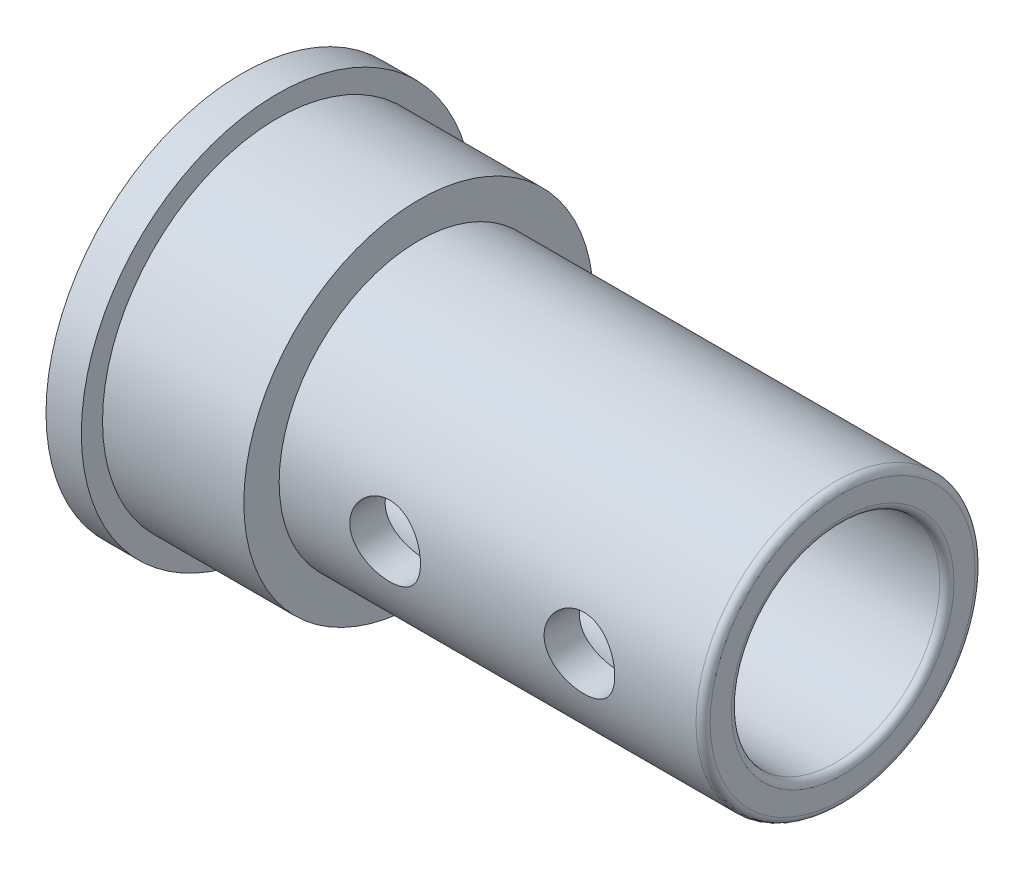
ISO-10303-21;
HEADER;
FILE_DESCRIPTION(('STEP AP214'),'2;1');
FILE_NAME('part.step','',(''),(''),'','','');
FILE_SCHEMA(('AUTOMOTIVE_DESIGN { 1 0 10303 214 1 1 1 1 }'));
ENDSEC;
DATA;
#1=APPLICATION_CONTEXT('core data for automotive mechanical design processes');
#2=APPLICATION_PROTOCOL_DEFINITION('international standard','automotive_design',2000,#1);
#3=PRODUCT_CONTEXT('',#1,'mechanical');
#4=PRODUCT('Part','Part','',(#3));
#5=PRODUCT_RELATED_PRODUCT_CATEGORY('part','',(#4));
#6=PRODUCT_DEFINITION_FORMATION('','',#4);
#7=PRODUCT_DEFINITION_CONTEXT('part definition',#1,'design');
#8=PRODUCT_DEFINITION('design','',#6,#7);
#9=PRODUCT_DEFINITION_SHAPE('','',#8);
#10=(LENGTH_UNIT() NAMED_UNIT(*) SI_UNIT(.MILLI.,.METRE.));
#11=(NAMED_UNIT(*) PLANE_ANGLE_UNIT() SI_UNIT($,.RADIAN.));
#12=(NAMED_UNIT(*) SI_UNIT($,.STERADIAN.) SOLID_ANGLE_UNIT());
#13=UNCERTAINTY_MEASURE_WITH_UNIT(LENGTH_MEASURE(1.E-05),#10,'distance_accuracy_value','');
#14=(GEOMETRIC_REPRESENTATION_CONTEXT(3) GLOBAL_UNCERTAINTY_ASSIGNED_CONTEXT((#13)) GLOBAL_UNIT_ASSIGNED_CONTEXT((#10,
#11,#12)) REPRESENTATION_CONTEXT('',''));
#15=CARTESIAN_POINT('',(0.,0.,0.));
#16=DIRECTION('',(0.,0.,1.));
#17=DIRECTION('',(1.,0.,0.));
#18=AXIS2_PLACEMENT_3D('',#15,#16,#17);
#19=CARTESIAN_POINT('',(-11.3005884112895,0.,0.));
#20=DIRECTION('',(-1.,0.,0.));
#21=DIRECTION('',(0.,0.,1.));
#22=AXIS2_PLACEMENT_3D('',#19,#20,#21);
#23=CYLINDRICAL_SURFACE('',#22,4.05);
#24=CARTESIAN_POINT('',(1.,0.,0.));
#25=DIRECTION('',(-1.,0.,0.));
#26=DIRECTION('',(0.,0.,1.));
#27=AXIS2_PLACEMENT_3D('',#24,#25,#26);
#28=CIRCLE('',#27,4.05);
#29=CARTESIAN_POINT('',(1.,0.,4.05));
#30=VERTEX_POINT('',#29);
#31=EDGE_CURVE('E79',#30,#30,#28,.T.);
#32=ORIENTED_EDGE('',*,*,#31,.F.);
#33=EDGE_LOOP('',(#32));
#34=FACE_BOUND('',#33,.T.);
#35=CARTESIAN_POINT('',(0.,0.,0.));
#36=DIRECTION('',(-1.,0.,0.));
#37=DIRECTION('',(0.,0.,1.));
#38=AXIS2_PLACEMENT_3D('',#35,#36,#37);
#39=CIRCLE('',#38,4.05);
#40=CARTESIAN_POINT('',(0.,0.,4.05));
#41=VERTEX_POINT('',#40);
#42=EDGE_CURVE('E10',#41,#41,#39,.T.);
#43=ORIENTED_EDGE('',*,*,#42,.T.);
#44=EDGE_LOOP('',(#43));
#45=FACE_BOUND('',#44,.T.);
#46=ADVANCED_FACE('F31',(#34,#45),#23,.F.);
#47=CARTESIAN_POINT('',(0.,4.05,0.));
#48=DIRECTION('',(1.,0.,0.));
#49=DIRECTION('',(0.,0.,-1.));
#50=AXIS2_PLACEMENT_3D('',#47,#48,#49);
#51=PLANE('',#50);
#52=ORIENTED_EDGE('',*,*,#42,.F.);
#53=EDGE_LOOP('',(#52));
#54=FACE_BOUND('',#53,.T.);
#55=CARTESIAN_POINT('',(0.,0.,0.));
#56=DIRECTION('',(-1.,0.,0.));
#57=DIRECTION('',(0.,0.,1.));
#58=AXIS2_PLACEMENT_3D('',#55,#56,#57);
#59=CIRCLE('',#58,5.55);
#60=CARTESIAN_POINT('',(0.,0.,5.55));
#61=VERTEX_POINT('',#60);
#62=EDGE_CURVE('E43',#61,#61,#59,.T.);
#63=ORIENTED_EDGE('',*,*,#62,.T.);
#64=EDGE_LOOP('',(#63));
#65=FACE_BOUND('',#64,.T.);
#66=ADVANCED_FACE('F107',(#54,#65),#51,.F.);
#67=CARTESIAN_POINT('',(-11.3005884112895,0.,0.));
#68=DIRECTION('',(-1.,0.,0.));
#69=DIRECTION('',(0.,0.,1.));
#70=AXIS2_PLACEMENT_3D('',#67,#68,#69);
#71=CYLINDRICAL_SURFACE('',#70,5.55);
#72=ORIENTED_EDGE('',*,*,#62,.F.);
#73=EDGE_LOOP('',(#72));
#74=FACE_BOUND('',#73,.T.);
#75=CARTESIAN_POINT('',(1.,0.,0.));
#76=DIRECTION('',(-1.,0.,0.));
#77=DIRECTION('',(0.,0.,1.));
#78=AXIS2_PLACEMENT_3D('',#75,#76,#77);
#79=CIRCLE('',#78,5.55);
#80=CARTESIAN_POINT('',(1.,0.,5.55));
#81=VERTEX_POINT('',#80);
#82=EDGE_CURVE('E48',#81,#81,#79,.T.);
#83=ORIENTED_EDGE('',*,*,#82,.T.);
#84=EDGE_LOOP('',(#83));
#85=FACE_BOUND('',#84,.T.);
#86=ADVANCED_FACE('F104',(#74,#85),#71,.T.);
#87=CARTESIAN_POINT('',(1.,5.55,0.));
#88=DIRECTION('',(-1.,0.,0.));
#89=DIRECTION('',(0.,0.,1.));
#90=AXIS2_PLACEMENT_3D('',#87,#88,#89);
#91=PLANE('',#90);
#92=ORIENTED_EDGE('',*,*,#82,.F.);
#93=EDGE_LOOP('',(#92));
#94=FACE_BOUND('',#93,.T.);
#95=CARTESIAN_POINT('',(1.,0.,0.));
#96=DIRECTION('',(-1.,0.,0.));
#97=DIRECTION('',(0.,0.,1.));
#98=AXIS2_PLACEMENT_3D('',#95,#96,#97);
#99=CIRCLE('',#98,4.95);
#100=CARTESIAN_POINT('',(1.,0.,4.95));
#101=VERTEX_POINT('',#100);
#102=EDGE_CURVE('E120',#101,#101,#99,.T.);
#103=ORIENTED_EDGE('',*,*,#102,.T.);
#104=EDGE_LOOP('',(#103));
#105=FACE_BOUND('',#104,.T.);
#106=ADVANCED_FACE('F100',(#94,#105),#91,.F.);
#107=CARTESIAN_POINT('',(-11.3005884112895,0.,0.));
#108=DIRECTION('',(-1.,0.,0.));
#109=DIRECTION('',(0.,0.,1.));
#110=AXIS2_PLACEMENT_3D('',#107,#108,#109);
#111=CYLINDRICAL_SURFACE('',#110,4.95);
#112=ORIENTED_EDGE('',*,*,#102,.F.);
#113=EDGE_LOOP('',(#112));
#114=FACE_BOUND('',#113,.T.);
#115=CARTESIAN_POINT('',(5.,0.,0.));
#116=DIRECTION('',(-1.,0.,0.));
#117=DIRECTION('',(0.,0.,1.));
#118=AXIS2_PLACEMENT_3D('',#115,#116,#117);
#119=CIRCLE('',#118,4.95);
#120=CARTESIAN_POINT('',(5.,0.,4.95));
#121=VERTEX_POINT('',#120);
#122=EDGE_CURVE('E122',#121,#121,#119,.T.);
#123=ORIENTED_EDGE('',*,*,#122,.T.);
#124=EDGE_LOOP('',(#123));
#125=FACE_BOUND('',#124,.T.);
#126=ADVANCED_FACE('F96',(#114,#125),#111,.T.);
#127=CARTESIAN_POINT('',(5.,4.95,0.));
#128=DIRECTION('',(-1.,0.,0.));
#129=DIRECTION('',(0.,0.,1.));
#130=AXIS2_PLACEMENT_3D('',#127,#128,#129);
#131=PLANE('',#130);
#132=ORIENTED_EDGE('',*,*,#122,.F.);
#133=EDGE_LOOP('',(#132));
#134=FACE_BOUND('',#133,.T.);
#135=CARTESIAN_POINT('',(5.,0.,0.));
#136=DIRECTION('',(-1.,0.,0.));
#137=DIRECTION('',(0.,0.,1.));
#138=AXIS2_PLACEMENT_3D('',#135,#136,#137);
#139=CIRCLE('',#138,3.95);
#140=CARTESIAN_POINT('',(5.,0.,3.95));
#141=VERTEX_POINT('',#140);
#142=EDGE_CURVE('E127',#141,#141,#139,.T.);
#143=ORIENTED_EDGE('',*,*,#142,.T.);
#144=EDGE_LOOP('',(#143));
#145=FACE_BOUND('',#144,.T.);
#146=ADVANCED_FACE('F90',(#134,#145),#131,.F.);
#147=CARTESIAN_POINT('',(-11.3005884112895,0.,0.));
#148=DIRECTION('',(-1.,0.,0.));
#149=DIRECTION('',(0.,0.,1.));
#150=AXIS2_PLACEMENT_3D('',#147,#148,#149);
#151=CYLINDRICAL_SURFACE('',#150,3.95);
#152=CARTESIAN_POINT('',(9.,0.,3.95));
#153=CARTESIAN_POINT('',(8.99999849195131,-0.0552278420748467,3.94999908204684));
#154=CARTESIAN_POINT('',(8.99540944639528,-0.110472396400866,3.94883021486781));
#155=CARTESIAN_POINT('',(8.97720292985002,-0.219376684770793,3.9442806794472));
#156=CARTESIAN_POINT('',(8.96358048531595,-0.273035528756149,3.94089879279058));
#157=CARTESIAN_POINT('',(8.92777342430357,-0.377180122437892,3.93229748362604));
#158=CARTESIAN_POINT('',(8.90559923130497,-0.427669648348493,3.92708029878769));
#159=CARTESIAN_POINT('',(8.85335515603603,-0.524212415434037,3.91536323222111));
#160=CARTESIAN_POINT('',(8.82328495843814,-0.570265479338115,3.90886329926881));
#161=CARTESIAN_POINT('',(8.7554330059679,-0.657598787580674,3.89513247989479));
#162=CARTESIAN_POINT('',(8.71751606390646,-0.698772196504416,3.88789008700224));
#163=CARTESIAN_POINT('',(8.63533629741954,-0.774248675231094,3.87356657479427));
#164=CARTESIAN_POINT('',(8.59107273956107,-0.808550949886453,3.86648547422801));
#165=CARTESIAN_POINT('',(8.49662238533746,-0.869817310360343,3.85316997858545));
#166=CARTESIAN_POINT('',(8.44635541535428,-0.8966612577612,3.8469501747132));
#167=CARTESIAN_POINT('',(8.34183928759349,-0.941476144800428,3.83622956373611));
#168=CARTESIAN_POINT('',(8.28759078602261,-0.959448542826902,3.83172847412054));
#169=CARTESIAN_POINT('',(8.17782785604774,-0.98564447800774,3.82507328273172));
#170=CARTESIAN_POINT('',(8.12236221381551,-0.994060408757434,3.82287293653175));
#171=CARTESIAN_POINT('',(8.01076603027492,-1.00150389012776,3.82092998774723));
#172=CARTESIAN_POINT('',(7.95463560164393,-1.0005330096412,3.8211869744489));
#173=CARTESIAN_POINT('',(7.84478270311336,-0.989383789300828,3.82408811953594));
#174=CARTESIAN_POINT('',(7.79103507820566,-0.97943535862688,3.826672667255));
#175=CARTESIAN_POINT('',(7.68599767170283,-0.9509804658599,3.83384263855054));
#176=CARTESIAN_POINT('',(7.63470806947546,-0.932473380267745,3.83842820790033));
#177=CARTESIAN_POINT('',(7.53542933500218,-0.88723219927939,3.84913783092387));
#178=CARTESIAN_POINT('',(7.4874797148559,-0.860415192377697,3.85527726966644));
#179=CARTESIAN_POINT('',(7.39667892145032,-0.799373363875983,3.86839426326203));
#180=CARTESIAN_POINT('',(7.35382866334816,-0.765147215691905,3.87537196810434));
#181=CARTESIAN_POINT('',(7.27312615646522,-0.689070600726192,3.88962974437686));
#182=CARTESIAN_POINT('',(7.23545691065745,-0.64702629279569,3.89691268804759));
#183=CARTESIAN_POINT('',(7.16766857722189,-0.557129757116954,3.91077635595212));
#184=CARTESIAN_POINT('',(7.13754973193502,-0.509277343022366,3.91735705764256));
#185=CARTESIAN_POINT('',(7.08564750727797,-0.408857714757762,3.92910890000827));
#186=CARTESIAN_POINT('',(7.06389448076683,-0.356274170552657,3.93427488867099));
#187=CARTESIAN_POINT('',(7.02958812707898,-0.248036539264748,3.94257781835689));
#188=CARTESIAN_POINT('',(7.01703299394499,-0.192383057256602,3.94571515768035));
#189=CARTESIAN_POINT('',(7.0017597574516,-0.0811494612569945,3.94954811388858));
#190=CARTESIAN_POINT('',(6.99879251744885,-0.0256056354836756,3.95030555646106));
#191=CARTESIAN_POINT('',(7.00209510880267,0.0851851389097108,3.94946977470528));
#192=CARTESIAN_POINT('',(7.00836408603732,0.140432114506925,3.94787676773552));
#193=CARTESIAN_POINT('',(7.02975597918696,0.248190844735719,3.94255875874206));
#194=CARTESIAN_POINT('',(7.04474241559262,0.300731462997949,3.93886663987927));
#195=CARTESIAN_POINT('',(7.08298744611331,0.402549796122121,3.92976700717265));
#196=CARTESIAN_POINT('',(7.10624688775546,0.451827176068224,3.92435931758351));
#197=CARTESIAN_POINT('',(7.16085665649059,0.546707172047589,3.91228090485966));
#198=CARTESIAN_POINT('',(7.19234578221967,0.592227150944134,3.90558909631277));
#199=CARTESIAN_POINT('',(7.26234419267327,0.677425134789227,3.89171704587319));
#200=CARTESIAN_POINT('',(7.30085472145263,0.717102102215167,3.88453671756594));
#201=CARTESIAN_POINT('',(7.38496068560975,0.790518789323267,3.87027341917478));
#202=CARTESIAN_POINT('',(7.43071030112566,0.824083545405221,3.86319747090773));
#203=CARTESIAN_POINT('',(7.52733910684638,0.883059964621525,3.85014558107988));
#204=CARTESIAN_POINT('',(7.57821807076087,0.908471987221514,3.84416959102531));
#205=CARTESIAN_POINT('',(7.68339100494804,0.950231584598357,3.83406073969026));
#206=CARTESIAN_POINT('',(7.73766257957136,0.966632792137009,3.82991700223302));
#207=CARTESIAN_POINT('',(7.84831420738048,0.990044181657133,3.82393269795229));
#208=CARTESIAN_POINT('',(7.90469378241328,0.997056480178925,3.82209161204859));
#209=CARTESIAN_POINT('',(8.0161786121732,1.00137829764814,3.82096134400262));
#210=CARTESIAN_POINT('',(8.07127244041182,0.998967740557092,3.82159853697847));
#211=CARTESIAN_POINT('',(8.18024058639087,0.985154533235011,3.82518240754788));
#212=CARTESIAN_POINT('',(8.23411492983508,0.973752072713339,3.82812903641743));
#213=CARTESIAN_POINT('',(8.3388015753129,0.94243340484457,3.83595820613519));
#214=CARTESIAN_POINT('',(8.38963094106241,0.922570964111819,3.8408285072964));
#215=CARTESIAN_POINT('',(8.48727252322742,0.874938511416825,3.85195770365967));
#216=CARTESIAN_POINT('',(8.53408416728139,0.847167375213229,3.85821679625402));
#217=CARTESIAN_POINT('',(8.6237111284221,0.783633699377764,3.87162721456458));
#218=CARTESIAN_POINT('',(8.66638630390867,0.747677518801082,3.8787979067106));
#219=CARTESIAN_POINT('',(8.74518829252082,0.669170094379429,3.8931093778377));
#220=CARTESIAN_POINT('',(8.7813135421814,0.626617280405067,3.90025014928039));
#221=CARTESIAN_POINT('',(8.84665004491909,0.535163954139942,3.91385664534171));
#222=CARTESIAN_POINT('',(8.87571934871468,0.486159605851862,3.92030724668927));
#223=CARTESIAN_POINT('',(8.92516098884412,0.383800172167367,3.93164601340821));
#224=CARTESIAN_POINT('',(8.94553943804653,0.330448176331423,3.93653527636488));
#225=CARTESIAN_POINT('',(8.97406341120274,0.231008135572119,3.9434943052563));
#226=CARTESIAN_POINT('',(8.98376832398155,0.185385804626639,3.94591699651009));
#227=CARTESIAN_POINT('',(8.99673699934204,0.093179563550085,3.94917016803465));
#228=CARTESIAN_POINT('',(9.00000127234066,0.0465957299132145,3.95000077447707));
#229=CARTESIAN_POINT('',(9.,0.,3.95));
#230=B_SPLINE_CURVE_WITH_KNOTS('',3,(#152,#153,#154,#155,#156,#157,#158,#159,#160,#161,#162,
#163,#164,#165,#166,#167,#168,#169,#170,#171,#172,#173,#174,#175,#176,#177,#178,#179,#180,#181,
#182,#183,#184,#185,#186,#187,#188,#189,#190,#191,#192,#193,#194,#195,#196,#197,#198,#199,#200,
#201,#202,#203,#204,#205,#206,#207,#208,#209,#210,#211,#212,#213,#214,#215,#216,#217,#218,#219,
#220,#221,#222,#223,#224,#225,#226,#227,#228,#229),.UNSPECIFIED.,.T.,.F.,(4,2,2,2,2,2,2,2,2,2,2,
2,2,2,2,2,2,2,2,2,2,2,2,2,2,2,2,2,2,2,2,2,2,2,2,2,2,2,4),(0.,0.165512747530337,
0.331116697640765,0.496519432574113,0.661928773883153,0.830468884011721,0.999028486836981,
1.17016372163742,1.34127081425357,1.50886841059758,1.6764379954995,1.83983434666397,
2.00324260314946,2.16833681236569,2.3334606056793,2.50341757273773,2.67337999411054,
2.84395338273746,3.01449327120702,3.18056455367168,3.34662047960914,3.51014407075122,
3.6736844188773,3.84018425250061,4.00671361534652,4.17744263350461,4.34816412294206,
4.51785814720793,4.68751391093159,4.85216858434357,5.01681978399747,5.18043981589751,
5.3440831184249,5.51209741294958,5.68015175977973,5.85134922932129,6.02242608465511,
6.16208025636818,6.30172336012491),.UNSPECIFIED.);
#231=CARTESIAN_POINT('',(9.,0.,3.95));
#232=VERTEX_POINT('',#231);
#233=EDGE_CURVE('E34',#232,#232,#230,.T.);
#234=ORIENTED_EDGE('',*,*,#233,.T.);
#235=EDGE_LOOP('',(#234));
#236=FACE_BOUND('',#235,.T.);
#237=CARTESIAN_POINT('',(14.5,0.,3.95));
#238=CARTESIAN_POINT('',(14.4999984919513,-0.0552278420748468,3.94999908204684));
#239=CARTESIAN_POINT('',(14.4954094463953,-0.110472396400866,3.94883021486781));
#240=CARTESIAN_POINT('',(14.47720292985,-0.219376684770793,3.9442806794472));
#241=CARTESIAN_POINT('',(14.463580485316,-0.273035528756149,3.94089879279058));
#242=CARTESIAN_POINT('',(14.4277734243036,-0.377180122437892,3.93229748362604));
#243=CARTESIAN_POINT('',(14.405599231305,-0.427669648348492,3.92708029878769));
#244=CARTESIAN_POINT('',(14.353355156036,-0.524212415434037,3.91536323222111));
#245=CARTESIAN_POINT('',(14.3232849584381,-0.570265479338115,3.90886329926881));
#246=CARTESIAN_POINT('',(14.2554330059679,-0.657598787580674,3.89513247989479));
#247=CARTESIAN_POINT('',(14.2175160639065,-0.698772196504417,3.88789008700224));
#248=CARTESIAN_POINT('',(14.1353362974195,-0.774248675231094,3.87356657479427));
#249=CARTESIAN_POINT('',(14.0910727395611,-0.808550949886453,3.86648547422801));
#250=CARTESIAN_POINT('',(13.9966223853375,-0.869817310360343,3.85316997858545));
#251=CARTESIAN_POINT('',(13.9463554153543,-0.8966612577612,3.8469501747132));
#252=CARTESIAN_POINT('',(13.8418392875935,-0.941476144800428,3.83622956373611));
#253=CARTESIAN_POINT('',(13.7875907860226,-0.959448542826902,3.83172847412054));
#254=CARTESIAN_POINT('',(13.6778278560477,-0.98564447800774,3.82507328273172));
#255=CARTESIAN_POINT('',(13.6223622138155,-0.994060408757434,3.82287293653175));
#256=CARTESIAN_POINT('',(13.5107660302749,-1.00150389012776,3.82092998774723));
#257=CARTESIAN_POINT('',(13.4546356016439,-1.0005330096412,3.8211869744489));
#258=CARTESIAN_POINT('',(13.3447827031134,-0.989383789300828,3.82408811953594));
#259=CARTESIAN_POINT('',(13.2910350782057,-0.97943535862688,3.826672667255));
#260=CARTESIAN_POINT('',(13.1859976717028,-0.9509804658599,3.83384263855054));
#261=CARTESIAN_POINT('',(13.1347080694755,-0.932473380267745,3.83842820790033));
#262=CARTESIAN_POINT('',(13.0354293350022,-0.887232199279389,3.84913783092387));
#263=CARTESIAN_POINT('',(12.9874797148559,-0.860415192377697,3.85527726966643));
#264=CARTESIAN_POINT('',(12.8966789214503,-0.799373363875982,3.86839426326203));
#265=CARTESIAN_POINT('',(12.8538286633482,-0.765147215691904,3.87537196810434));
#266=CARTESIAN_POINT('',(12.7731261564652,-0.689070600726191,3.88962974437686));
#267=CARTESIAN_POINT('',(12.7354569106575,-0.64702629279569,3.89691268804759));
#268=CARTESIAN_POINT('',(12.6676685772219,-0.557129757116954,3.91077635595212));
#269=CARTESIAN_POINT('',(12.637549731935,-0.509277343022367,3.91735705764256));
#270=CARTESIAN_POINT('',(12.585647507278,-0.408857714757763,3.92910890000827));
#271=CARTESIAN_POINT('',(12.5638944807668,-0.356274170552657,3.93427488867099));
#272=CARTESIAN_POINT('',(12.529588127079,-0.248036539264749,3.94257781835689));
#273=CARTESIAN_POINT('',(12.517032993945,-0.192383057256602,3.94571515768035));
#274=CARTESIAN_POINT('',(12.5017597574516,-0.0811494612569943,3.94954811388858));
#275=CARTESIAN_POINT('',(12.4987925174488,-0.0256056354836757,3.95030555646106));
#276=CARTESIAN_POINT('',(12.5020951088027,0.0851851389097106,3.94946977470528));
#277=CARTESIAN_POINT('',(12.5083640860373,0.140432114506924,3.94787676773552));
#278=CARTESIAN_POINT('',(12.529755979187,0.248190844735719,3.94255875874206));
#279=CARTESIAN_POINT('',(12.5447424155926,0.300731462997949,3.93886663987927));
#280=CARTESIAN_POINT('',(12.5829874461133,0.402549796122122,3.92976700717265));
#281=CARTESIAN_POINT('',(12.6062468877555,0.451827176068224,3.92435931758351));
#282=CARTESIAN_POINT('',(12.6608566564906,0.546707172047589,3.91228090485966));
#283=CARTESIAN_POINT('',(12.6923457822197,0.592227150944135,3.90558909631277));
#284=CARTESIAN_POINT('',(12.7623441926733,0.677425134789227,3.89171704587319));
#285=CARTESIAN_POINT('',(12.8008547214526,0.717102102215167,3.88453671756594));
#286=CARTESIAN_POINT('',(12.8849606856097,0.790518789323266,3.87027341917478));
#287=CARTESIAN_POINT('',(12.9307103011257,0.824083545405221,3.86319747090773));
#288=CARTESIAN_POINT('',(13.0273391068464,0.883059964621524,3.85014558107988));
#289=CARTESIAN_POINT('',(13.0782180707609,0.908471987221513,3.84416959102531));
#290=CARTESIAN_POINT('',(13.183391004948,0.950231584598357,3.83406073969026));
#291=CARTESIAN_POINT('',(13.2376625795714,0.966632792137008,3.82991700223301));
#292=CARTESIAN_POINT('',(13.3483142073805,0.990044181657133,3.82393269795229));
#293=CARTESIAN_POINT('',(13.4046937824133,0.997056480178925,3.82209161204859));
#294=CARTESIAN_POINT('',(13.5161786121732,1.00137829764814,3.82096134400262));
#295=CARTESIAN_POINT('',(13.5712724404118,0.998967740557092,3.82159853697847));
#296=CARTESIAN_POINT('',(13.6802405863909,0.985154533235012,3.82518240754788));
#297=CARTESIAN_POINT('',(13.7341149298351,0.973752072713339,3.82812903641742));
#298=CARTESIAN_POINT('',(13.8388015753129,0.94243340484457,3.83595820613518));
#299=CARTESIAN_POINT('',(13.8896309410624,0.922570964111818,3.8408285072964));
#300=CARTESIAN_POINT('',(13.9872725232274,0.874938511416824,3.85195770365967));
#301=CARTESIAN_POINT('',(14.0340841672814,0.847167375213228,3.85821679625402));
#302=CARTESIAN_POINT('',(14.1237111284221,0.783633699377764,3.87162721456458));
#303=CARTESIAN_POINT('',(14.1663863039087,0.747677518801082,3.8787979067106));
#304=CARTESIAN_POINT('',(14.2451882925208,0.669170094379429,3.8931093778377));
#305=CARTESIAN_POINT('',(14.2813135421814,0.626617280405067,3.90025014928039));
#306=CARTESIAN_POINT('',(14.3466500449191,0.535163954139942,3.91385664534171));
#307=CARTESIAN_POINT('',(14.3757193487147,0.486159605851861,3.92030724668928));
#308=CARTESIAN_POINT('',(14.4251609888441,0.383800172167366,3.93164601340821));
#309=CARTESIAN_POINT('',(14.4455394380465,0.330448176331422,3.93653527636488));
#310=CARTESIAN_POINT('',(14.4740634112027,0.231008135572119,3.9434943052563));
#311=CARTESIAN_POINT('',(14.4837683239816,0.18538580462664,3.94591699651009));
#312=CARTESIAN_POINT('',(14.496736999342,0.0931795635500852,3.94917016803465));
#313=CARTESIAN_POINT('',(14.5000012723407,0.0465957299132146,3.95000077447707));
#314=CARTESIAN_POINT('',(14.5,0.,3.95));
#315=B_SPLINE_CURVE_WITH_KNOTS('',3,(#237,#238,#239,#240,#241,#242,#243,#244,#245,#246,#247,
#248,#249,#250,#251,#252,#253,#254,#255,#256,#257,#258,#259,#260,#261,#262,#263,#264,#265,#266,
#267,#268,#269,#270,#271,#272,#273,#274,#275,#276,#277,#278,#279,#280,#281,#282,#283,#284,#285,
#286,#287,#288,#289,#290,#291,#292,#293,#294,#295,#296,#297,#298,#299,#300,#301,#302,#303,#304,
#305,#306,#307,#308,#309,#310,#311,#312,#313,#314),.UNSPECIFIED.,.T.,.F.,(4,2,2,2,2,2,2,2,2,2,2,
2,2,2,2,2,2,2,2,2,2,2,2,2,2,2,2,2,2,2,2,2,2,2,2,2,2,2,4),(0.,0.165512747530337,
0.331116697640764,0.496519432574112,0.661928773883153,0.830468884011723,0.999028486836981,
1.17016372163742,1.34127081425357,1.50886841059758,1.6764379954995,1.83983434666397,
2.00324260314946,2.16833681236569,2.3334606056793,2.50341757273773,2.67337999411054,
2.84395338273746,3.01449327120702,3.18056455367168,3.34662047960914,3.51014407075122,
3.6736844188773,3.84018425250062,4.00671361534652,4.17744263350461,4.34816412294206,
4.51785814720793,4.6875139109316,4.85216858434356,5.01681978399747,5.18043981589751,
5.3440831184249,5.51209741294958,5.68015175977973,5.85134922932129,6.02242608465511,
6.16208025636818,6.3017233601249),.UNSPECIFIED.);
#316=CARTESIAN_POINT('',(14.5,0.,3.95));
#317=VERTEX_POINT('',#316);
#318=EDGE_CURVE('E58',#317,#317,#315,.T.);
#319=ORIENTED_EDGE('',*,*,#318,.T.);
#320=EDGE_LOOP('',(#319));
#321=FACE_BOUND('',#320,.T.);
#322=ORIENTED_EDGE('',*,*,#142,.F.);
#323=EDGE_LOOP('',(#322));
#324=FACE_BOUND('',#323,.T.);
#325=CARTESIAN_POINT('',(16.8,0.,0.));
#326=DIRECTION('',(-1.,0.,0.));
#327=DIRECTION('',(0.,0.,1.));
#328=AXIS2_PLACEMENT_3D('',#325,#326,#327);
#329=CIRCLE('',#328,3.95);
#330=CARTESIAN_POINT('',(16.8,0.,3.95));
#331=VERTEX_POINT('',#330);
#332=EDGE_CURVE('E130',#331,#331,#329,.T.);
#333=ORIENTED_EDGE('',*,*,#332,.T.);
#334=EDGE_LOOP('',(#333));
#335=FACE_BOUND('',#334,.T.);
#336=ADVANCED_FACE('F84',(#236,#321,#324,#335),#151,.T.);
#337=CARTESIAN_POINT('',(16.8,0.,0.));
#338=DIRECTION('',(-1.,0.,0.));
#339=DIRECTION('',(0.,0.,1.));
#340=AXIS2_PLACEMENT_3D('',#337,#338,#339);
#341=TOROIDAL_SURFACE('',#340,3.75,0.2);
#342=ORIENTED_EDGE('',*,*,#332,.F.);
#343=EDGE_LOOP('',(#342));
#344=FACE_BOUND('',#343,.T.);
#345=CARTESIAN_POINT('',(17.,0.,0.));
#346=DIRECTION('',(-1.,0.,0.));
#347=DIRECTION('',(0.,0.,1.));
#348=AXIS2_PLACEMENT_3D('',#345,#346,#347);
#349=CIRCLE('',#348,3.75);
#350=CARTESIAN_POINT('',(17.,0.,3.75));
#351=VERTEX_POINT('',#350);
#352=EDGE_CURVE('E133',#351,#351,#349,.T.);
#353=ORIENTED_EDGE('',*,*,#352,.T.);
#354=EDGE_LOOP('',(#353));
#355=FACE_BOUND('',#354,.T.);
#356=ADVANCED_FACE('F89',(#344,#355),#341,.T.);
#357=CARTESIAN_POINT('',(17.,3.75,0.));
#358=DIRECTION('',(-1.,0.,0.));
#359=DIRECTION('',(0.,0.,1.));
#360=AXIS2_PLACEMENT_3D('',#357,#358,#359);
#361=PLANE('',#360);
#362=ORIENTED_EDGE('',*,*,#352,.F.);
#363=EDGE_LOOP('',(#362));
#364=FACE_BOUND('',#363,.T.);
#365=CARTESIAN_POINT('',(17.,0.,0.));
#366=DIRECTION('',(-1.,0.,0.));
#367=DIRECTION('',(0.,0.,1.));
#368=AXIS2_PLACEMENT_3D('',#365,#366,#367);
#369=CIRCLE('',#368,3.15);
#370=CARTESIAN_POINT('',(17.,0.,3.15));
#371=VERTEX_POINT('',#370);
#372=EDGE_CURVE('E136',#371,#371,#369,.T.);
#373=ORIENTED_EDGE('',*,*,#372,.T.);
#374=EDGE_LOOP('',(#373));
#375=FACE_BOUND('',#374,.T.);
#376=ADVANCED_FACE('F158',(#364,#375),#361,.F.);
#377=CARTESIAN_POINT('',(16.8,0.,0.));
#378=DIRECTION('',(-1.,0.,0.));
#379=DIRECTION('',(0.,0.,1.));
#380=AXIS2_PLACEMENT_3D('',#377,#378,#379);
#381=TOROIDAL_SURFACE('',#380,3.15,0.199999999999998);
#382=ORIENTED_EDGE('',*,*,#372,.F.);
#383=EDGE_LOOP('',(#382));
#384=FACE_BOUND('',#383,.T.);
#385=CARTESIAN_POINT('',(16.8,0.,0.));
#386=DIRECTION('',(-1.,0.,0.));
#387=DIRECTION('',(0.,0.,1.));
#388=AXIS2_PLACEMENT_3D('',#385,#386,#387);
#389=CIRCLE('',#388,2.95);
#390=CARTESIAN_POINT('',(16.8,0.,2.95));
#391=VERTEX_POINT('',#390);
#392=EDGE_CURVE('E139',#391,#391,#389,.T.);
#393=ORIENTED_EDGE('',*,*,#392,.T.);
#394=EDGE_LOOP('',(#393));
#395=FACE_BOUND('',#394,.T.);
#396=ADVANCED_FACE('F153',(#384,#395),#381,.T.);
#397=CARTESIAN_POINT('',(-11.3005884112895,0.,0.));
#398=DIRECTION('',(-1.,0.,0.));
#399=DIRECTION('',(0.,0.,1.));
#400=AXIS2_PLACEMENT_3D('',#397,#398,#399);
#401=CYLINDRICAL_SURFACE('',#400,2.95);
#402=CARTESIAN_POINT('',(9.,0.,2.95));
#403=CARTESIAN_POINT('',(9.00000044311192,0.054510594200719,2.95000029145323));
#404=CARTESIAN_POINT('',(8.99552845651715,0.109018159605019,2.94847528228185));
#405=CARTESIAN_POINT('',(8.97781565640715,0.216424634263978,2.94254220100316));
#406=CARTESIAN_POINT('',(8.96457422728383,0.269323430311579,2.93813392649313));
#407=CARTESIAN_POINT('',(8.92983079699399,0.371948437480399,2.92691256858244));
#408=CARTESIAN_POINT('',(8.90834288664003,0.421679892567579,2.92010358888568));
#409=CARTESIAN_POINT('',(8.85778118564125,0.516832633719903,2.90477359776748));
#410=CARTESIAN_POINT('',(8.82870581977978,0.562253022099601,2.89625223092528));
#411=CARTESIAN_POINT('',(8.76270603496662,0.649114506456161,2.87805212517248));
#412=CARTESIAN_POINT('',(8.72555929010404,0.690380683942872,2.86834498138472));
#413=CARTESIAN_POINT('',(8.64494376123031,0.76623230059783,2.84902142411235));
#414=CARTESIAN_POINT('',(8.60147352457992,0.800816200444481,2.8394050320173));
#415=CARTESIAN_POINT('',(8.50785301001318,0.863334427116425,2.82103698115251));
#416=CARTESIAN_POINT('',(8.45754178479005,0.891038849022137,2.81231980220229));
#417=CARTESIAN_POINT('',(8.35263099165502,0.937517979182632,2.79717036428471));
#418=CARTESIAN_POINT('',(8.29803279005227,0.956295519186465,2.79073738089826));
#419=CARTESIAN_POINT('',(8.18809069126239,0.983727158375595,2.78118438099379));
#420=CARTESIAN_POINT('',(8.13283838388081,0.992709878628599,2.77795716747215));
#421=CARTESIAN_POINT('',(8.02152381305751,1.00132430200658,2.77486442926219));
#422=CARTESIAN_POINT('',(7.96546181592742,1.00095901276314,2.77499782333068));
#423=CARTESIAN_POINT('',(7.85694690176606,0.991142426596308,2.77851748109882));
#424=CARTESIAN_POINT('',(7.80444899458246,0.982123280106034,2.78174902529329));
#425=CARTESIAN_POINT('',(7.70176102657653,0.955961201291614,2.79084718738855));
#426=CARTESIAN_POINT('',(7.65157125178363,0.938817265083653,2.79671413090967));
#427=CARTESIAN_POINT('',(7.55395567753871,0.896615470659463,2.81052999703594));
#428=CARTESIAN_POINT('',(7.50658915933264,0.871431681072123,2.81851167992763));
#429=CARTESIAN_POINT('',(7.4166192304174,0.813952497428975,2.83564432870023));
#430=CARTESIAN_POINT('',(7.37401723852563,0.781654993453516,2.84479564115325));
#431=CARTESIAN_POINT('',(7.2923617706474,0.708802410900542,2.86384170465827));
#432=CARTESIAN_POINT('',(7.25362505736164,0.667895067787686,2.87374988855844));
#433=CARTESIAN_POINT('',(7.18347738657487,0.580043724493488,2.89276108171158));
#434=CARTESIAN_POINT('',(7.1520671805718,0.533099105819369,2.90186400830793));
#435=CARTESIAN_POINT('',(7.09719740717318,0.433816526300885,2.91836574353378));
#436=CARTESIAN_POINT('',(7.07382535388824,0.381426819797735,2.92574552997507));
#437=CARTESIAN_POINT('',(7.03632528891014,0.273148927632301,2.93783107442794));
#438=CARTESIAN_POINT('',(7.02219395147473,0.217262008563375,2.94253779439834));
#439=CARTESIAN_POINT('',(7.00414376510709,0.106255730020249,2.94858626021517));
#440=CARTESIAN_POINT('',(6.99979708813533,0.0512135225540003,2.95006887300377));
#441=CARTESIAN_POINT('',(7.00021740085273,-0.0588264167007466,2.94992621550637));
#442=CARTESIAN_POINT('',(7.00498279242117,-0.113824154596116,2.94830149020105));
#443=CARTESIAN_POINT('',(7.02315498255285,-0.220484091349986,2.94221974696513));
#444=CARTESIAN_POINT('',(7.03629690990465,-0.272196862531277,2.93784959987832));
#445=CARTESIAN_POINT('',(7.07051570301197,-0.372660887428653,2.92680371325276));
#446=CARTESIAN_POINT('',(7.09159358673075,-0.421411760283175,2.92012767794154));
#447=CARTESIAN_POINT('',(7.14171038303796,-0.516024725809124,2.90492292611899));
#448=CARTESIAN_POINT('',(7.17094742327391,-0.561774455970629,2.89634937221122));
#449=CARTESIAN_POINT('',(7.23632109906455,-0.647856248499979,2.87831889193654));
#450=CARTESIAN_POINT('',(7.2724599048338,-0.688186599966311,2.86886168819079));
#451=CARTESIAN_POINT('',(7.35262204996125,-0.764261935456543,2.84956437810693));
#452=CARTESIAN_POINT('',(7.39693645853112,-0.799701706965583,2.83972720323154));
#453=CARTESIAN_POINT('',(7.49109293112331,-0.862682533128118,2.82123372566443));
#454=CARTESIAN_POINT('',(7.54093508695055,-0.890223456570155,2.81257744259031));
#455=CARTESIAN_POINT('',(7.64479518232469,-0.936512653561718,2.79750590572115));
#456=CARTESIAN_POINT('',(7.69880719420529,-0.955273150279018,2.79108753973357));
#457=CARTESIAN_POINT('',(7.80949315509845,-0.983342710747911,2.78132383589306));
#458=CARTESIAN_POINT('',(7.86616583704176,-0.99265622653465,2.77797705058134));
#459=CARTESIAN_POINT('',(7.97732715256414,-1.0012130412189,2.77490377995049));
#460=CARTESIAN_POINT('',(8.0317720260804,-1.00096466168768,2.774994545988));
#461=CARTESIAN_POINT('',(8.13980064019606,-0.991662453519265,2.77833213287195));
#462=CARTESIAN_POINT('',(8.19338443523365,-0.982609183779361,2.78157875339805));
#463=CARTESIAN_POINT('',(8.2970828949493,-0.956319110319581,2.79072393876646));
#464=CARTESIAN_POINT('',(8.34724593290943,-0.939252370092525,2.79656726385443));
#465=CARTESIAN_POINT('',(8.44403414168795,-0.897558955070586,2.81022541613495));
#466=CARTESIAN_POINT('',(8.49065850766784,-0.872930566836286,2.81804069009169));
#467=CARTESIAN_POINT('',(8.58131353863496,-0.815524784033993,2.83519909106955));
#468=CARTESIAN_POINT('',(8.62513405640123,-0.782431417487263,2.84459502582165));
#469=CARTESIAN_POINT('',(8.7067638004903,-0.709563253946507,2.86364041951063));
#470=CARTESIAN_POINT('',(8.74457129407179,-0.669786537813098,2.87328995059496));
#471=CARTESIAN_POINT('',(8.81466013670961,-0.582731818354928,2.89222829691784));
#472=CARTESIAN_POINT('',(8.8466528498294,-0.535213861139582,2.90148630083584));
#473=CARTESIAN_POINT('',(8.9021644961136,-0.435166420690443,2.9181667911611));
#474=CARTESIAN_POINT('',(8.92568525353892,-0.382638019437335,2.92558967261604));
#475=CARTESIAN_POINT('',(8.96280345624649,-0.275855804130924,2.93754850740182));
#476=CARTESIAN_POINT('',(8.97670617469494,-0.221718263426618,2.94217262446318));
#477=CARTESIAN_POINT('',(8.99530283739835,-0.111719073250952,2.94839776770193));
#478=CARTESIAN_POINT('',(8.99999954593556,-0.0558579464385239,2.94999970134285));
#479=CARTESIAN_POINT('',(9.,0.,2.95));
#480=B_SPLINE_CURVE_WITH_KNOTS('',3,(#402,#403,#404,#405,#406,#407,#408,#409,#410,#411,#412,
#413,#414,#415,#416,#417,#418,#419,#420,#421,#422,#423,#424,#425,#426,#427,#428,#429,#430,#431,
#432,#433,#434,#435,#436,#437,#438,#439,#440,#441,#442,#443,#444,#445,#446,#447,#448,#449,#450,
#451,#452,#453,#454,#455,#456,#457,#458,#459,#460,#461,#462,#463,#464,#465,#466,#467,#468,#469,
#470,#471,#472,#473,#474,#475,#476,#477,#478,#479),.UNSPECIFIED.,.T.,.F.,(4,2,2,2,2,2,2,2,2,2,2,
2,2,2,2,2,2,2,2,2,2,2,2,2,2,2,2,2,2,2,2,2,2,2,2,2,2,2,4),(0.,0.163326163829833,
0.326663794245684,0.489723562440059,0.65281721011977,0.821155186128154,0.989531894162838,
1.16294623953724,1.33630553835416,1.50365030097474,1.67094122271476,1.83029057834212,
1.989659628013,2.15165868113474,2.31370584785113,2.4845217535855,2.65535517263155,
2.82799363774169,3.00056993586089,3.16544045199785,3.33028205496084,3.49015366619605,
3.65004579151897,3.814220943994,3.97844780551215,4.15040529467121,4.32236564013113,
4.49408588355601,4.66572516352205,4.82825316593058,4.99077085242025,5.14998549601005,
5.30923624366533,5.47563018101018,5.6420719806756,5.81530911598364,5.98850892591587,
6.15592234094365,6.32328547915534),.UNSPECIFIED.);
#481=CARTESIAN_POINT('',(9.,0.,2.95));
#482=VERTEX_POINT('',#481);
#483=EDGE_CURVE('E59',#482,#482,#480,.T.);
#484=ORIENTED_EDGE('',*,*,#483,.T.);
#485=EDGE_LOOP('',(#484));
#486=FACE_BOUND('',#485,.T.);
#487=CARTESIAN_POINT('',(14.5,0.,2.95));
#488=CARTESIAN_POINT('',(14.5000004431119,0.054510594200719,2.95000029145323));
#489=CARTESIAN_POINT('',(14.4955284565171,0.109018159605019,2.94847528228185));
#490=CARTESIAN_POINT('',(14.4778156564071,0.216424634263978,2.94254220100316));
#491=CARTESIAN_POINT('',(14.4645742272838,0.269323430311579,2.93813392649313));
#492=CARTESIAN_POINT('',(14.429830796994,0.371948437480398,2.92691256858244));
#493=CARTESIAN_POINT('',(14.40834288664,0.421679892567579,2.92010358888568));
#494=CARTESIAN_POINT('',(14.3577811856413,0.516832633719903,2.90477359776748));
#495=CARTESIAN_POINT('',(14.3287058197798,0.562253022099601,2.89625223092528));
#496=CARTESIAN_POINT('',(14.2627060349666,0.649114506456161,2.87805212517248));
#497=CARTESIAN_POINT('',(14.225559290104,0.690380683942871,2.86834498138472));
#498=CARTESIAN_POINT('',(14.1449437612303,0.76623230059783,2.84902142411235));
#499=CARTESIAN_POINT('',(14.1014735245799,0.800816200444481,2.8394050320173));
#500=CARTESIAN_POINT('',(14.0078530100132,0.863334427116425,2.82103698115251));
#501=CARTESIAN_POINT('',(13.9575417847901,0.891038849022136,2.81231980220229));
#502=CARTESIAN_POINT('',(13.852630991655,0.937517979182632,2.79717036428471));
#503=CARTESIAN_POINT('',(13.7980327900523,0.956295519186465,2.79073738089826));
#504=CARTESIAN_POINT('',(13.6880906912624,0.983727158375595,2.78118438099379));
#505=CARTESIAN_POINT('',(13.6328383838808,0.992709878628599,2.77795716747215));
#506=CARTESIAN_POINT('',(13.5215238130575,1.00132430200658,2.77486442926219));
#507=CARTESIAN_POINT('',(13.4654618159274,1.00095901276314,2.77499782333068));
#508=CARTESIAN_POINT('',(13.3569469017661,0.991142426596308,2.77851748109882));
#509=CARTESIAN_POINT('',(13.3044489945825,0.982123280106034,2.78174902529329));
#510=CARTESIAN_POINT('',(13.2017610265765,0.955961201291614,2.79084718738855));
#511=CARTESIAN_POINT('',(13.1515712517836,0.938817265083652,2.79671413090967));
#512=CARTESIAN_POINT('',(13.0539556775387,0.896615470659463,2.81052999703594));
#513=CARTESIAN_POINT('',(13.0065891593326,0.871431681072123,2.81851167992763));
#514=CARTESIAN_POINT('',(12.9166192304174,0.813952497428975,2.83564432870023));
#515=CARTESIAN_POINT('',(12.8740172385256,0.781654993453516,2.84479564115325));
#516=CARTESIAN_POINT('',(12.7923617706474,0.708802410900543,2.86384170465827));
#517=CARTESIAN_POINT('',(12.7536250573616,0.667895067787687,2.87374988855844));
#518=CARTESIAN_POINT('',(12.6834773865749,0.580043724493488,2.89276108171158));
#519=CARTESIAN_POINT('',(12.6520671805718,0.533099105819369,2.90186400830793));
#520=CARTESIAN_POINT('',(12.5971974071732,0.433816526300885,2.91836574353378));
#521=CARTESIAN_POINT('',(12.5738253538882,0.381426819797735,2.92574552997507));
#522=CARTESIAN_POINT('',(12.5363252889101,0.2731489276323,2.93783107442794));
#523=CARTESIAN_POINT('',(12.5221939514747,0.217262008563374,2.94253779439834));
#524=CARTESIAN_POINT('',(12.5041437651071,0.106255730020249,2.94858626021517));
#525=CARTESIAN_POINT('',(12.4997970881353,0.0512135225540001,2.95006887300377));
#526=CARTESIAN_POINT('',(12.5002174008527,-0.0588264167007467,2.94992621550637));
#527=CARTESIAN_POINT('',(12.5049827924212,-0.113824154596116,2.94830149020105));
#528=CARTESIAN_POINT('',(12.5231549825529,-0.220484091349986,2.94221974696513));
#529=CARTESIAN_POINT('',(12.5362969099047,-0.272196862531276,2.93784959987832));
#530=CARTESIAN_POINT('',(12.570515703012,-0.372660887428652,2.92680371325276));
#531=CARTESIAN_POINT('',(12.5915935867308,-0.421411760283174,2.92012767794154));
#532=CARTESIAN_POINT('',(12.641710383038,-0.516024725809123,2.90492292611899));
#533=CARTESIAN_POINT('',(12.6709474232739,-0.561774455970629,2.89634937221122));
#534=CARTESIAN_POINT('',(12.7363210990646,-0.647856248499979,2.87831889193654));
#535=CARTESIAN_POINT('',(12.7724599048338,-0.688186599966311,2.86886168819079));
#536=CARTESIAN_POINT('',(12.8526220499613,-0.764261935456543,2.84956437810693));
#537=CARTESIAN_POINT('',(12.8969364585311,-0.799701706965582,2.83972720323154));
#538=CARTESIAN_POINT('',(12.9910929311233,-0.862682533128118,2.82123372566443));
#539=CARTESIAN_POINT('',(13.0409350869506,-0.890223456570155,2.81257744259031));
#540=CARTESIAN_POINT('',(13.1447951823247,-0.936512653561718,2.79750590572115));
#541=CARTESIAN_POINT('',(13.1988071942053,-0.955273150279017,2.79108753973357));
#542=CARTESIAN_POINT('',(13.3094931550984,-0.983342710747911,2.78132383589306));
#543=CARTESIAN_POINT('',(13.3661658370418,-0.99265622653465,2.77797705058134));
#544=CARTESIAN_POINT('',(13.4773271525641,-1.0012130412189,2.77490377995049));
#545=CARTESIAN_POINT('',(13.5317720260804,-1.00096466168768,2.774994545988));
#546=CARTESIAN_POINT('',(13.6398006401961,-0.991662453519265,2.77833213287195));
#547=CARTESIAN_POINT('',(13.6933844352336,-0.982609183779361,2.78157875339805));
#548=CARTESIAN_POINT('',(13.7970828949493,-0.956319110319581,2.79072393876646));
#549=CARTESIAN_POINT('',(13.8472459329094,-0.939252370092525,2.79656726385443));
#550=CARTESIAN_POINT('',(13.944034141688,-0.897558955070586,2.81022541613495));
#551=CARTESIAN_POINT('',(13.9906585076678,-0.872930566836286,2.81804069009169));
#552=CARTESIAN_POINT('',(14.081313538635,-0.815524784033993,2.83519909106955));
#553=CARTESIAN_POINT('',(14.1251340564012,-0.782431417487263,2.84459502582165));
#554=CARTESIAN_POINT('',(14.2067638004903,-0.709563253946507,2.86364041951063));
#555=CARTESIAN_POINT('',(14.2445712940718,-0.669786537813098,2.87328995059496));
#556=CARTESIAN_POINT('',(14.3146601367096,-0.582731818354928,2.89222829691784));
#557=CARTESIAN_POINT('',(14.3466528498294,-0.535213861139581,2.90148630083584));
#558=CARTESIAN_POINT('',(14.4021644961136,-0.435166420690443,2.9181667911611));
#559=CARTESIAN_POINT('',(14.4256852535389,-0.382638019437335,2.92558967261604));
#560=CARTESIAN_POINT('',(14.4628034562465,-0.275855804130924,2.93754850740182));
#561=CARTESIAN_POINT('',(14.4767061746949,-0.221718263426618,2.94217262446318));
#562=CARTESIAN_POINT('',(14.4953028373984,-0.111719073250952,2.94839776770193));
#563=CARTESIAN_POINT('',(14.4999995459356,-0.0558579464385239,2.94999970134285));
#564=CARTESIAN_POINT('',(14.5,0.,2.95));
#565=B_SPLINE_CURVE_WITH_KNOTS('',3,(#487,#488,#489,#490,#491,#492,#493,#494,#495,#496,#497,
#498,#499,#500,#501,#502,#503,#504,#505,#506,#507,#508,#509,#510,#511,#512,#513,#514,#515,#516,
#517,#518,#519,#520,#521,#522,#523,#524,#525,#526,#527,#528,#529,#530,#531,#532,#533,#534,#535,
#536,#537,#538,#539,#540,#541,#542,#543,#544,#545,#546,#547,#548,#549,#550,#551,#552,#553,#554,
#555,#556,#557,#558,#559,#560,#561,#562,#563,#564),.UNSPECIFIED.,.T.,.F.,(4,2,2,2,2,2,2,2,2,2,2,
2,2,2,2,2,2,2,2,2,2,2,2,2,2,2,2,2,2,2,2,2,2,2,2,2,2,2,4),(0.,0.163326163829833,
0.326663794245684,0.489723562440059,0.65281721011977,0.821155186128154,0.989531894162838,
1.16294623953724,1.33630553835416,1.50365030097474,1.67094122271476,1.83029057834212,
1.989659628013,2.15165868113474,2.31370584785113,2.4845217535855,2.65535517263155,
2.82799363774169,3.00056993586089,3.16544045199785,3.33028205496084,3.49015366619605,
3.65004579151897,3.814220943994,3.97844780551215,4.15040529467121,4.32236564013113,
4.49408588355601,4.66572516352205,4.82825316593057,4.99077085242025,5.14998549601005,
5.30923624366533,5.47563018101018,5.6420719806756,5.81530911598364,5.98850892591587,
6.15592234094365,6.32328547915534),.UNSPECIFIED.);
#566=CARTESIAN_POINT('',(14.5,0.,2.95));
#567=VERTEX_POINT('',#566);
#568=EDGE_CURVE('E51',#567,#567,#565,.T.);
#569=ORIENTED_EDGE('',*,*,#568,.T.);
#570=EDGE_LOOP('',(#569));
#571=FACE_BOUND('',#570,.T.);
#572=ORIENTED_EDGE('',*,*,#392,.F.);
#573=EDGE_LOOP('',(#572));
#574=FACE_BOUND('',#573,.T.);
#575=CARTESIAN_POINT('',(1.,0.,0.));
#576=DIRECTION('',(-1.,0.,0.));
#577=DIRECTION('',(0.,0.,1.));
#578=AXIS2_PLACEMENT_3D('',#575,#576,#577);
#579=CIRCLE('',#578,2.95);
#580=CARTESIAN_POINT('',(1.,0.,2.95));
#581=VERTEX_POINT('',#580);
#582=EDGE_CURVE('E141',#581,#581,#579,.T.);
#583=ORIENTED_EDGE('',*,*,#582,.T.);
#584=EDGE_LOOP('',(#583));
#585=FACE_BOUND('',#584,.T.);
#586=ADVANCED_FACE('F60',(#486,#571,#574,#585),#401,.F.);
#587=CARTESIAN_POINT('',(1.,2.95,0.));
#588=DIRECTION('',(1.,0.,0.));
#589=DIRECTION('',(0.,0.,-1.));
#590=AXIS2_PLACEMENT_3D('',#587,#588,#589);
#591=PLANE('',#590);
#592=ORIENTED_EDGE('',*,*,#582,.F.);
#593=EDGE_LOOP('',(#592));
#594=FACE_BOUND('',#593,.T.);
#595=ORIENTED_EDGE('',*,*,#31,.T.);
#596=EDGE_LOOP('',(#595));
#597=FACE_BOUND('',#596,.T.);
#598=ADVANCED_FACE('F68',(#594,#597),#591,.F.);
#599=CARTESIAN_POINT('',(13.5,0.,0.));
#600=DIRECTION('',(0.,0.,-1.));
#601=DIRECTION('',(-1.,0.,0.));
#602=AXIS2_PLACEMENT_3D('',#599,#600,#601);
#603=CYLINDRICAL_SURFACE('',#602,0.999999999999999);
#604=ORIENTED_EDGE('',*,*,#568,.F.);
#605=EDGE_LOOP('',(#604));
#606=FACE_BOUND('',#605,.T.);
#607=ORIENTED_EDGE('',*,*,#318,.F.);
#608=EDGE_LOOP('',(#607));
#609=FACE_BOUND('',#608,.T.);
#610=ADVANCED_FACE('F64',(#606,#609),#603,.F.);
#611=CARTESIAN_POINT('',(8.,0.,0.));
#612=DIRECTION('',(0.,0.,-1.));
#613=DIRECTION('',(-1.,0.,0.));
#614=AXIS2_PLACEMENT_3D('',#611,#612,#613);
#615=CYLINDRICAL_SURFACE('',#614,0.999999999999999);
#616=ORIENTED_EDGE('',*,*,#233,.F.);
#617=EDGE_LOOP('',(#616));
#618=FACE_BOUND('',#617,.T.);
#619=ORIENTED_EDGE('',*,*,#483,.F.);
#620=EDGE_LOOP('',(#619));
#621=FACE_BOUND('',#620,.T.);
#622=ADVANCED_FACE('F67',(#618,#621),#615,.F.);
#623=CLOSED_SHELL('',(#46,#66,#86,#106,#126,#146,#336,#356,#376,#396,#586,#598,#610,#622));
#624=MANIFOLD_SOLID_BREP('B2',#623);
#625=ADVANCED_BREP_SHAPE_REPRESENTATION('',(#18,#624),#14);
#626=SHAPE_DEFINITION_REPRESENTATION(#9,#625);
ENDSEC;
END-ISO-10303-21;
